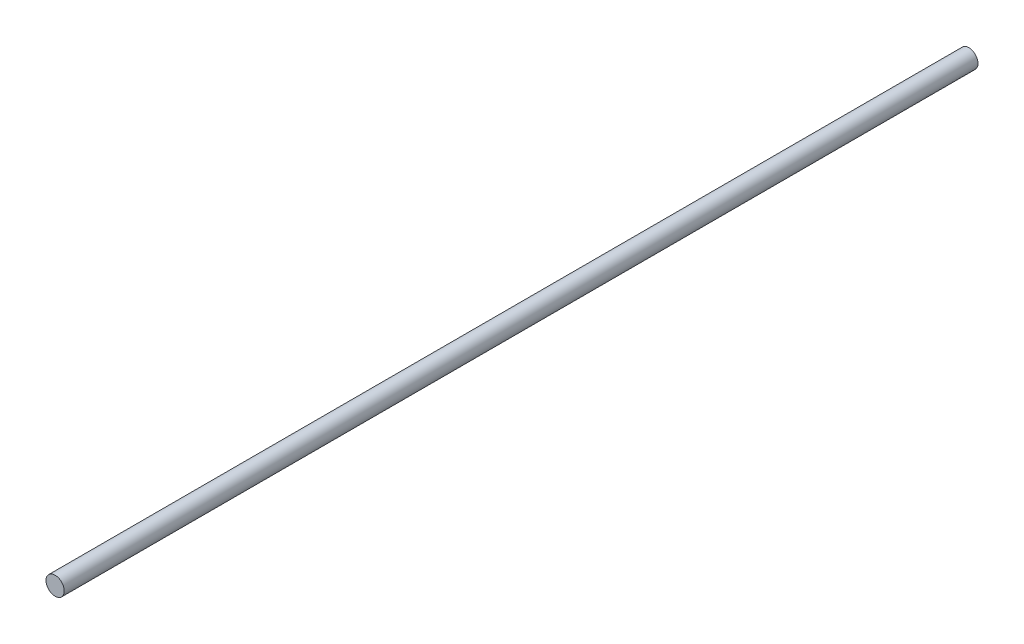
ISO-10303-21;
HEADER;
FILE_DESCRIPTION(('STEP AP214'),'2;1');
FILE_NAME('part.step','',(''),(''),'','','');
FILE_SCHEMA(('AUTOMOTIVE_DESIGN { 1 0 10303 214 1 1 1 1 }'));
ENDSEC;
DATA;
#1=APPLICATION_CONTEXT('core data for automotive mechanical design processes');
#2=APPLICATION_PROTOCOL_DEFINITION('international standard','automotive_design',2000,#1);
#3=PRODUCT_CONTEXT('',#1,'mechanical');
#4=PRODUCT('Part','Part','',(#3));
#5=PRODUCT_RELATED_PRODUCT_CATEGORY('part','',(#4));
#6=PRODUCT_DEFINITION_FORMATION('','',#4);
#7=PRODUCT_DEFINITION_CONTEXT('part definition',#1,'design');
#8=PRODUCT_DEFINITION('design','',#6,#7);
#9=PRODUCT_DEFINITION_SHAPE('','',#8);
#10=(LENGTH_UNIT() NAMED_UNIT(*) SI_UNIT(.MILLI.,.METRE.));
#11=(NAMED_UNIT(*) PLANE_ANGLE_UNIT() SI_UNIT($,.RADIAN.));
#12=(NAMED_UNIT(*) SI_UNIT($,.STERADIAN.) SOLID_ANGLE_UNIT());
#13=UNCERTAINTY_MEASURE_WITH_UNIT(LENGTH_MEASURE(1.E-05),#10,'distance_accuracy_value','');
#14=(GEOMETRIC_REPRESENTATION_CONTEXT(3) GLOBAL_UNCERTAINTY_ASSIGNED_CONTEXT((#13)) GLOBAL_UNIT_ASSIGNED_CONTEXT((#10,
#11,#12)) REPRESENTATION_CONTEXT('',''));
#15=CARTESIAN_POINT('',(0.,0.,0.));
#16=DIRECTION('',(0.,0.,1.));
#17=DIRECTION('',(1.,0.,0.));
#18=AXIS2_PLACEMENT_3D('',#15,#16,#17);
#19=CARTESIAN_POINT('',(0.,0.,-400.));
#20=DIRECTION('',(0.,0.,1.));
#21=DIRECTION('',(1.,0.,0.));
#22=AXIS2_PLACEMENT_3D('',#19,#20,#21);
#23=CYLINDRICAL_SURFACE('',#22,4.);
#24=CARTESIAN_POINT('',(0.,0.,-400.));
#25=DIRECTION('',(0.,0.,1.));
#26=DIRECTION('',(1.,0.,0.));
#27=AXIS2_PLACEMENT_3D('',#24,#25,#26);
#28=CIRCLE('',#27,4.);
#29=CARTESIAN_POINT('',(4.,0.,-400.));
#30=VERTEX_POINT('',#29);
#31=EDGE_CURVE('E10',#30,#30,#28,.T.);
#32=ORIENTED_EDGE('',*,*,#31,.T.);
#33=EDGE_LOOP('',(#32));
#34=FACE_BOUND('',#33,.T.);
#35=CARTESIAN_POINT('',(0.,0.,0.));
#36=DIRECTION('',(0.,0.,1.));
#37=DIRECTION('',(1.,0.,0.));
#38=AXIS2_PLACEMENT_3D('',#35,#36,#37);
#39=CIRCLE('',#38,4.);
#40=CARTESIAN_POINT('',(4.,0.,0.));
#41=VERTEX_POINT('',#40);
#42=EDGE_CURVE('E35',#41,#41,#39,.T.);
#43=ORIENTED_EDGE('',*,*,#42,.F.);
#44=EDGE_LOOP('',(#43));
#45=FACE_BOUND('',#44,.T.);
#46=ADVANCED_FACE('F32',(#34,#45),#23,.T.);
#47=CARTESIAN_POINT('',(0.,0.,-400.));
#48=DIRECTION('',(0.,0.,1.));
#49=DIRECTION('',(1.,0.,0.));
#50=AXIS2_PLACEMENT_3D('',#47,#48,#49);
#51=PLANE('',#50);
#52=ORIENTED_EDGE('',*,*,#31,.F.);
#53=EDGE_LOOP('',(#52));
#54=FACE_BOUND('',#53,.T.);
#55=ADVANCED_FACE('F47',(#54),#51,.F.);
#56=CARTESIAN_POINT('',(0.,0.,0.));
#57=DIRECTION('',(0.,0.,1.));
#58=DIRECTION('',(1.,0.,0.));
#59=AXIS2_PLACEMENT_3D('',#56,#57,#58);
#60=PLANE('',#59);
#61=ORIENTED_EDGE('',*,*,#42,.T.);
#62=EDGE_LOOP('',(#61));
#63=FACE_BOUND('',#62,.T.);
#64=ADVANCED_FACE('F44',(#63),#60,.T.);
#65=CLOSED_SHELL('',(#46,#55,#64));
#66=MANIFOLD_SOLID_BREP('B2',#65);
#67=ADVANCED_BREP_SHAPE_REPRESENTATION('',(#18,#66),#14);
#68=SHAPE_DEFINITION_REPRESENTATION(#9,#67);
ENDSEC;
END-ISO-10303-21;
